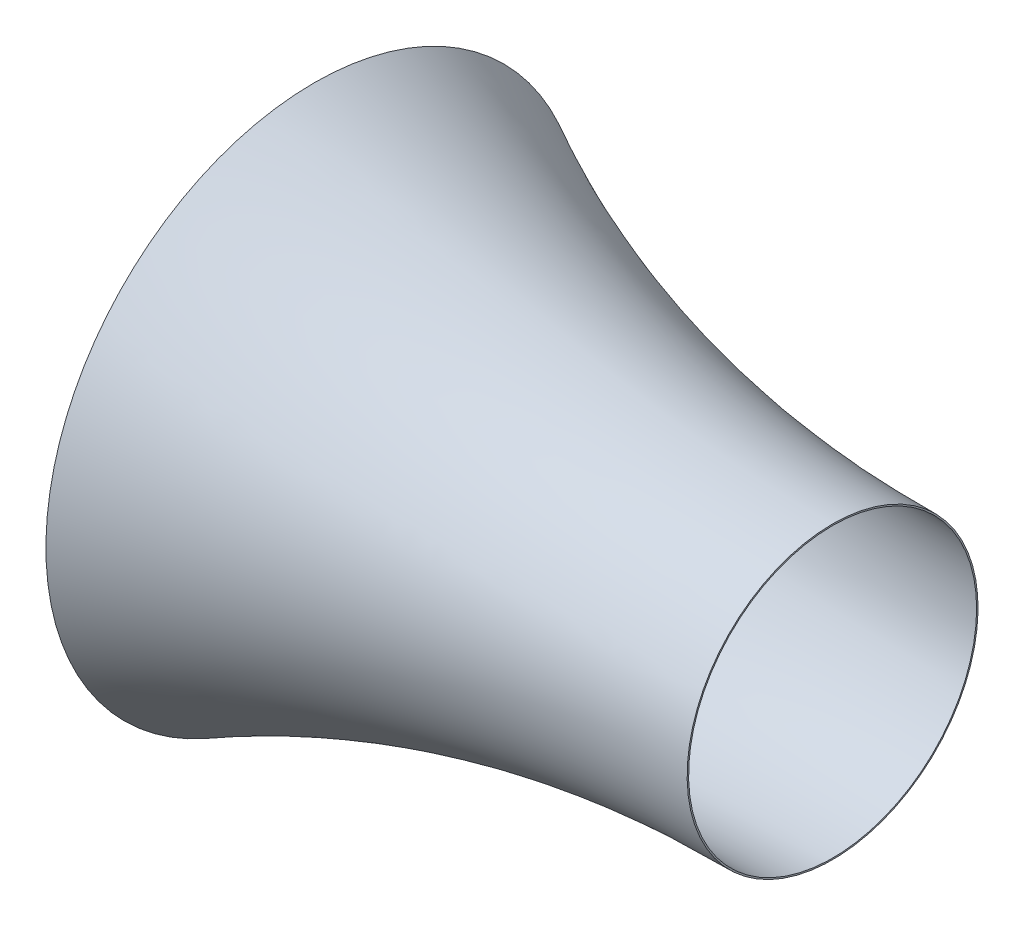
ISO-10303-21;
HEADER;
FILE_DESCRIPTION(('STEP AP214'),'2;1');
FILE_NAME('part.step','',(''),(''),'','','');
FILE_SCHEMA(('AUTOMOTIVE_DESIGN { 1 0 10303 214 1 1 1 1 }'));
ENDSEC;
DATA;
#1=APPLICATION_CONTEXT('core data for automotive mechanical design processes');
#2=APPLICATION_PROTOCOL_DEFINITION('international standard','automotive_design',2000,#1);
#3=PRODUCT_CONTEXT('',#1,'mechanical');
#4=PRODUCT('Part','Part','',(#3));
#5=PRODUCT_RELATED_PRODUCT_CATEGORY('part','',(#4));
#6=PRODUCT_DEFINITION_FORMATION('','',#4);
#7=PRODUCT_DEFINITION_CONTEXT('part definition',#1,'design');
#8=PRODUCT_DEFINITION('design','',#6,#7);
#9=PRODUCT_DEFINITION_SHAPE('','',#8);
#10=(LENGTH_UNIT() NAMED_UNIT(*) SI_UNIT(.MILLI.,.METRE.));
#11=(NAMED_UNIT(*) PLANE_ANGLE_UNIT() SI_UNIT($,.RADIAN.));
#12=(NAMED_UNIT(*) SI_UNIT($,.STERADIAN.) SOLID_ANGLE_UNIT());
#13=UNCERTAINTY_MEASURE_WITH_UNIT(LENGTH_MEASURE(1.E-05),#10,'distance_accuracy_value','');
#14=(GEOMETRIC_REPRESENTATION_CONTEXT(3) GLOBAL_UNCERTAINTY_ASSIGNED_CONTEXT((#13)) GLOBAL_UNIT_ASSIGNED_CONTEXT((#10,
#11,#12)) REPRESENTATION_CONTEXT('',''));
#15=CARTESIAN_POINT('',(0.,0.,0.));
#16=DIRECTION('',(0.,0.,1.));
#17=DIRECTION('',(1.,0.,0.));
#18=AXIS2_PLACEMENT_3D('',#15,#16,#17);
#19=CARTESIAN_POINT('',(58.1645223558109,0.,0.));
#20=DIRECTION('',(-1.,0.,0.));
#21=DIRECTION('',(0.,0.,1.));
#22=AXIS2_PLACEMENT_3D('',#19,#20,#21);
#23=PLANE('',#22);
#24=CARTESIAN_POINT('',(58.1645223558109,0.,0.));
#25=DIRECTION('',(1.,0.,0.));
#26=DIRECTION('',(0.,0.,-1.));
#27=AXIS2_PLACEMENT_3D('',#24,#25,#26);
#28=CIRCLE('',#27,825.);
#29=CARTESIAN_POINT('',(58.1645223558109,0.,-825.));
#30=VERTEX_POINT('',#29);
#31=EDGE_CURVE('E51',#30,#30,#28,.T.);
#32=ORIENTED_EDGE('',*,*,#31,.F.);
#33=EDGE_LOOP('',(#32));
#34=FACE_BOUND('',#33,.T.);
#35=CARTESIAN_POINT('',(58.1645223558109,0.,0.));
#36=DIRECTION('',(1.,0.,0.));
#37=DIRECTION('',(0.,0.,-1.));
#38=AXIS2_PLACEMENT_3D('',#35,#36,#37);
#39=CIRCLE('',#38,830.);
#40=CARTESIAN_POINT('',(58.1645223558109,0.,-830.));
#41=VERTEX_POINT('',#40);
#42=EDGE_CURVE('E114',#41,#41,#39,.T.);
#43=ORIENTED_EDGE('',*,*,#42,.T.);
#44=EDGE_LOOP('',(#43));
#45=FACE_BOUND('',#44,.T.);
#46=ADVANCED_FACE('F33',(#34,#45),#23,.F.);
#47=CARTESIAN_POINT('',(1798.,0.,0.));
#48=DIRECTION('',(-1.,0.,0.));
#49=DIRECTION('',(0.,0.,1.));
#50=AXIS2_PLACEMENT_3D('',#47,#48,#49);
#51=CONICAL_SURFACE('',#50,500.,1.56125332618035);
#52=CARTESIAN_POINT('',(1797.95228572115,0.,0.));
#53=DIRECTION('',(1.,0.,0.));
#54=DIRECTION('',(0.,1.,0.));
#55=AXIS2_PLACEMENT_3D('',#52,#53,#54);
#56=CIRCLE('',#55,504.999772329576);
#57=CARTESIAN_POINT('',(1797.95228572115,504.999772329576,0.));
#58=VERTEX_POINT('',#57);
#59=EDGE_CURVE('E10',#58,#58,#56,.T.);
#60=ORIENTED_EDGE('',*,*,#59,.T.);
#61=EDGE_LOOP('',(#60));
#62=FACE_BOUND('',#61,.T.);
#63=CARTESIAN_POINT('',(1798.,0.,0.));
#64=DIRECTION('',(1.,0.,0.));
#65=DIRECTION('',(0.,0.,-1.));
#66=AXIS2_PLACEMENT_3D('',#63,#64,#65);
#67=CIRCLE('',#66,500.);
#68=CARTESIAN_POINT('',(1798.,0.,-500.));
#69=VERTEX_POINT('',#68);
#70=EDGE_CURVE('E36',#69,#69,#67,.T.);
#71=ORIENTED_EDGE('',*,*,#70,.F.);
#72=EDGE_LOOP('',(#71));
#73=FACE_BOUND('',#72,.T.);
#74=ADVANCED_FACE('F150',(#62,#73),#51,.T.);
#75=CARTESIAN_POINT('',(1798.,500.,0.));
#76=CARTESIAN_POINT('',(832.327730928075,490.784309186942,0.));
#77=CARTESIAN_POINT('',(-8.32327730928075,929.16647044547,0.));
#78=CARTESIAN_POINT('',(-16.6465546185615,933.506887883673,0.));
#79=B_SPLINE_CURVE_WITH_KNOTS('',2,(#75,#76,#77,#78),.UNSPECIFIED.,.F.,.F.,(3,1,3),(0.,1.,1.01),.UNSPECIFIED.);
#80=CARTESIAN_POINT('',(0.,0.,0.));
#81=DIRECTION('',(1.,0.,0.));
#82=AXIS1_PLACEMENT('',#80,#81);
#83=SURFACE_OF_REVOLUTION('',#79,#82);
#84=OFFSET_SURFACE('',#83,-5.,.F.);
#85=CARTESIAN_POINT('',(-1.81806021389195,0.,0.));
#86=DIRECTION('',(1.,0.,0.));
#87=DIRECTION('',(0.,0.,-1.));
#88=AXIS2_PLACEMENT_3D('',#85,#86,#87);
#89=CIRCLE('',#88,931.413151414595);
#90=CARTESIAN_POINT('',(-1.81806021389195,0.,-931.413151414595));
#91=VERTEX_POINT('',#90);
#92=EDGE_CURVE('E40',#91,#91,#89,.T.);
#93=ORIENTED_EDGE('',*,*,#92,.T.);
#94=EDGE_LOOP('',(#93));
#95=FACE_BOUND('',#94,.T.);
#96=ORIENTED_EDGE('',*,*,#59,.F.);
#97=EDGE_LOOP('',(#96));
#98=FACE_BOUND('',#97,.T.);
#99=ADVANCED_FACE('F70',(#95,#98),#84,.F.);
#100=CARTESIAN_POINT('',(2.44059559409774,928.793256243204,0.));
#101=CARTESIAN_POINT('',(1.22029779704887,926.809654625235,0.));
#102=CARTESIAN_POINT('',(-40.6448771597789,858.757553751385,0.));
#103=CARTESIAN_POINT('',(0.745532448811899,798.922234092078,0.));
#104=CARTESIAN_POINT('',(1.4910648976238,797.844468184157,0.));
#105=B_SPLINE_CURVE_WITH_KNOTS('',2,(#100,#101,#102,#103,#104),.UNSPECIFIED.,.F.,.F.,(3,1,1,3),
(-0.0300234096477094,0.,1.,1.01834259323459),.UNSPECIFIED.);
#106=CARTESIAN_POINT('',(0.,0.,0.));
#107=DIRECTION('',(1.,0.,0.));
#108=AXIS1_PLACEMENT('',#106,#107);
#109=SURFACE_OF_REVOLUTION('',#105,#108);
#110=OFFSET_SURFACE('',#109,-5.,.F.);
#111=CARTESIAN_POINT('',(-2.62099064058559,0.,0.));
#112=DIRECTION('',(1.,0.,0.));
#113=DIRECTION('',(0.,0.,-1.));
#114=AXIS2_PLACEMENT_3D('',#111,#112,#113);
#115=CIRCLE('',#114,795.);
#116=CARTESIAN_POINT('',(-2.62099064058559,0.,-795.));
#117=VERTEX_POINT('',#116);
#118=EDGE_CURVE('E45',#117,#117,#115,.T.);
#119=ORIENTED_EDGE('',*,*,#118,.T.);
#120=EDGE_LOOP('',(#119));
#121=FACE_BOUND('',#120,.T.);
#122=ORIENTED_EDGE('',*,*,#92,.F.);
#123=EDGE_LOOP('',(#122));
#124=FACE_BOUND('',#123,.T.);
#125=ADVANCED_FACE('F71',(#121,#124),#110,.F.);
#126=CARTESIAN_POINT('',(0.,0.,0.));
#127=DIRECTION('',(1.,0.,0.));
#128=DIRECTION('',(0.,0.,-1.));
#129=AXIS2_PLACEMENT_3D('',#126,#127,#128);
#130=CYLINDRICAL_SURFACE('',#129,795.);
#131=CARTESIAN_POINT('',(28.8211041168073,0.,0.));
#132=DIRECTION('',(1.,0.,0.));
#133=DIRECTION('',(0.,0.,-1.));
#134=AXIS2_PLACEMENT_3D('',#131,#132,#133);
#135=CIRCLE('',#134,795.);
#136=CARTESIAN_POINT('',(28.8211041168073,0.,-795.));
#137=VERTEX_POINT('',#136);
#138=EDGE_CURVE('E54',#137,#137,#135,.T.);
#139=ORIENTED_EDGE('',*,*,#138,.T.);
#140=EDGE_LOOP('',(#139));
#141=FACE_BOUND('',#140,.T.);
#142=ORIENTED_EDGE('',*,*,#118,.F.);
#143=EDGE_LOOP('',(#142));
#144=FACE_BOUND('',#143,.T.);
#145=ADVANCED_FACE('F74',(#141,#144),#130,.F.);
#146=CARTESIAN_POINT('',(29.8245244772304,0.,0.));
#147=DIRECTION('',(1.,0.,0.));
#148=DIRECTION('',(0.,0.,-1.));
#149=AXIS2_PLACEMENT_3D('',#146,#147,#148);
#150=CONICAL_SURFACE('',#149,798.687002068317,1.30508097022597);
#151=CARTESIAN_POINT('',(36.9856264726182,0.,0.));
#152=DIRECTION('',(1.,0.,0.));
#153=DIRECTION('',(0.,0.,-1.));
#154=AXIS2_PLACEMENT_3D('',#151,#152,#153);
#155=CIRCLE('',#154,825.);
#156=CARTESIAN_POINT('',(36.9856264726182,0.,-825.));
#157=VERTEX_POINT('',#156);
#158=EDGE_CURVE('E49',#157,#157,#155,.T.);
#159=ORIENTED_EDGE('',*,*,#158,.T.);
#160=EDGE_LOOP('',(#159));
#161=FACE_BOUND('',#160,.T.);
#162=ORIENTED_EDGE('',*,*,#138,.F.);
#163=EDGE_LOOP('',(#162));
#164=FACE_BOUND('',#163,.T.);
#165=ADVANCED_FACE('F80',(#161,#164),#150,.F.);
#166=CARTESIAN_POINT('',(0.,0.,0.));
#167=DIRECTION('',(1.,0.,0.));
#168=DIRECTION('',(0.,0.,-1.));
#169=AXIS2_PLACEMENT_3D('',#166,#167,#168);
#170=CYLINDRICAL_SURFACE('',#169,825.);
#171=ORIENTED_EDGE('',*,*,#31,.T.);
#172=EDGE_LOOP('',(#171));
#173=FACE_BOUND('',#172,.T.);
#174=ORIENTED_EDGE('',*,*,#158,.F.);
#175=EDGE_LOOP('',(#174));
#176=FACE_BOUND('',#175,.T.);
#177=ADVANCED_FACE('F84',(#173,#176),#170,.F.);
#178=CARTESIAN_POINT('',(1798.,500.,0.));
#179=CARTESIAN_POINT('',(832.327730928075,490.784309186942,0.));
#180=CARTESIAN_POINT('',(0.,924.826053007267,0.));
#181=B_SPLINE_CURVE_WITH_KNOTS('',2,(#178,#179,#180),.UNSPECIFIED.,.F.,.F.,(3,3),(0.,1.),.UNSPECIFIED.);
#182=CARTESIAN_POINT('',(0.,0.,0.));
#183=DIRECTION('',(1.,0.,0.));
#184=AXIS1_PLACEMENT('',#182,#183);
#185=SURFACE_OF_REVOLUTION('',#181,#184);
#186=CARTESIAN_POINT('',(0.,0.,0.));
#187=DIRECTION('',(1.,0.,0.));
#188=DIRECTION('',(0.,0.,-1.));
#189=AXIS2_PLACEMENT_3D('',#186,#187,#188);
#190=CIRCLE('',#189,924.826053007267);
#191=CARTESIAN_POINT('',(0.,0.,-924.826053007267));
#192=VERTEX_POINT('',#191);
#193=EDGE_CURVE('E128',#192,#192,#190,.T.);
#194=ORIENTED_EDGE('',*,*,#193,.F.);
#195=EDGE_LOOP('',(#194));
#196=FACE_BOUND('',#195,.T.);
#197=ORIENTED_EDGE('',*,*,#70,.T.);
#198=EDGE_LOOP('',(#197));
#199=FACE_BOUND('',#198,.T.);
#200=ADVANCED_FACE('F88',(#196,#199),#185,.T.);
#201=CARTESIAN_POINT('',(0.,924.826053007267,0.));
#202=CARTESIAN_POINT('',(-40.6448771597789,858.757553751385,0.));
#203=CARTESIAN_POINT('',(0.,800.,0.));
#204=B_SPLINE_CURVE_WITH_KNOTS('',2,(#201,#202,#203),.UNSPECIFIED.,.F.,.F.,(3,3),(0.,1.),.UNSPECIFIED.);
#205=CARTESIAN_POINT('',(0.,0.,0.));
#206=DIRECTION('',(1.,0.,0.));
#207=AXIS1_PLACEMENT('',#205,#206);
#208=SURFACE_OF_REVOLUTION('',#204,#207);
#209=CARTESIAN_POINT('',(0.,0.,0.));
#210=DIRECTION('',(1.,0.,0.));
#211=DIRECTION('',(0.,0.,-1.));
#212=AXIS2_PLACEMENT_3D('',#209,#210,#211);
#213=CIRCLE('',#212,800.);
#214=CARTESIAN_POINT('',(0.,0.,-800.));
#215=VERTEX_POINT('',#214);
#216=EDGE_CURVE('E126',#215,#215,#213,.T.);
#217=ORIENTED_EDGE('',*,*,#216,.F.);
#218=EDGE_LOOP('',(#217));
#219=FACE_BOUND('',#218,.T.);
#220=ORIENTED_EDGE('',*,*,#193,.T.);
#221=EDGE_LOOP('',(#220));
#222=FACE_BOUND('',#221,.T.);
#223=ADVANCED_FACE('F101',(#219,#222),#208,.T.);
#224=CARTESIAN_POINT('',(0.,0.,0.));
#225=DIRECTION('',(1.,0.,0.));
#226=DIRECTION('',(0.,0.,-1.));
#227=AXIS2_PLACEMENT_3D('',#224,#225,#226);
#228=CYLINDRICAL_SURFACE('',#227,800.);
#229=CARTESIAN_POINT('',(25.,0.,0.));
#230=DIRECTION('',(1.,0.,0.));
#231=DIRECTION('',(0.,0.,-1.));
#232=AXIS2_PLACEMENT_3D('',#229,#230,#231);
#233=CIRCLE('',#232,800.);
#234=CARTESIAN_POINT('',(25.,0.,-800.));
#235=VERTEX_POINT('',#234);
#236=EDGE_CURVE('E120',#235,#235,#233,.T.);
#237=ORIENTED_EDGE('',*,*,#236,.F.);
#238=EDGE_LOOP('',(#237));
#239=FACE_BOUND('',#238,.T.);
#240=ORIENTED_EDGE('',*,*,#216,.T.);
#241=EDGE_LOOP('',(#240));
#242=FACE_BOUND('',#241,.T.);
#243=ADVANCED_FACE('F97',(#239,#242),#228,.T.);
#244=CARTESIAN_POINT('',(25.,0.,0.));
#245=DIRECTION('',(1.,0.,0.));
#246=DIRECTION('',(0.,0.,-1.));
#247=AXIS2_PLACEMENT_3D('',#244,#245,#246);
#248=CONICAL_SURFACE('',#247,800.,1.30508097022597);
#249=CARTESIAN_POINT('',(33.1645223558109,0.,0.));
#250=DIRECTION('',(1.,0.,0.));
#251=DIRECTION('',(0.,0.,-1.));
#252=AXIS2_PLACEMENT_3D('',#249,#250,#251);
#253=CIRCLE('',#252,830.);
#254=CARTESIAN_POINT('',(33.1645223558109,0.,-830.));
#255=VERTEX_POINT('',#254);
#256=EDGE_CURVE('E121',#255,#255,#253,.T.);
#257=ORIENTED_EDGE('',*,*,#256,.F.);
#258=EDGE_LOOP('',(#257));
#259=FACE_BOUND('',#258,.T.);
#260=ORIENTED_EDGE('',*,*,#236,.T.);
#261=EDGE_LOOP('',(#260));
#262=FACE_BOUND('',#261,.T.);
#263=ADVANCED_FACE('F93',(#259,#262),#248,.T.);
#264=CARTESIAN_POINT('',(0.,0.,0.));
#265=DIRECTION('',(1.,0.,0.));
#266=DIRECTION('',(0.,0.,-1.));
#267=AXIS2_PLACEMENT_3D('',#264,#265,#266);
#268=CYLINDRICAL_SURFACE('',#267,830.);
#269=ORIENTED_EDGE('',*,*,#42,.F.);
#270=EDGE_LOOP('',(#269));
#271=FACE_BOUND('',#270,.T.);
#272=ORIENTED_EDGE('',*,*,#256,.T.);
#273=EDGE_LOOP('',(#272));
#274=FACE_BOUND('',#273,.T.);
#275=ADVANCED_FACE('F90',(#271,#274),#268,.T.);
#276=CLOSED_SHELL('',(#46,#74,#99,#125,#145,#165,#177,#200,#223,#243,#263,#275));
#277=MANIFOLD_SOLID_BREP('B2',#276);
#278=ADVANCED_BREP_SHAPE_REPRESENTATION('',(#18,#277),#14);
#279=SHAPE_DEFINITION_REPRESENTATION(#9,#278);
ENDSEC;
END-ISO-10303-21;
